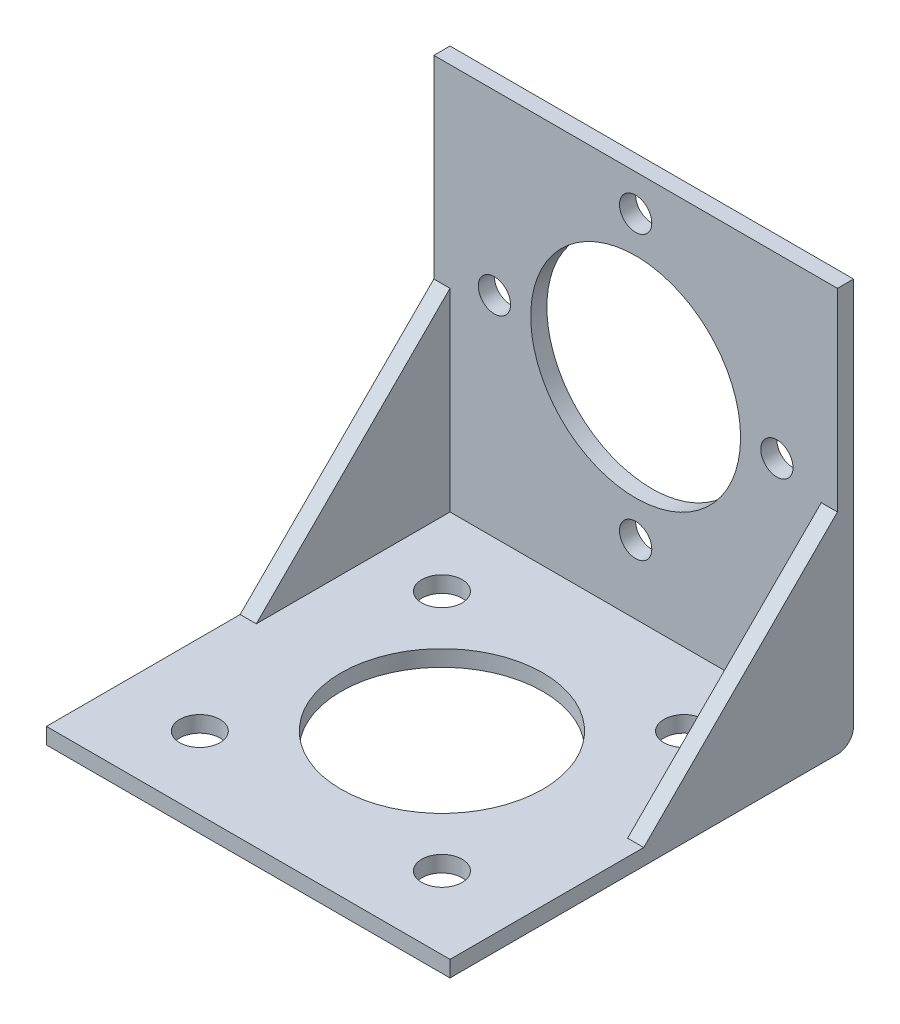
ISO-10303-21;
HEADER;
FILE_DESCRIPTION(('STEP AP214'),'2;1');
FILE_NAME('part.step','',(''),(''),'','','');
FILE_SCHEMA(('AUTOMOTIVE_DESIGN { 1 0 10303 214 1 1 1 1 }'));
ENDSEC;
DATA;
#1=APPLICATION_CONTEXT('core data for automotive mechanical design processes');
#2=APPLICATION_PROTOCOL_DEFINITION('international standard','automotive_design',2000,#1);
#3=PRODUCT_CONTEXT('',#1,'mechanical');
#4=PRODUCT('Part','Part','',(#3));
#5=PRODUCT_RELATED_PRODUCT_CATEGORY('part','',(#4));
#6=PRODUCT_DEFINITION_FORMATION('','',#4);
#7=PRODUCT_DEFINITION_CONTEXT('part definition',#1,'design');
#8=PRODUCT_DEFINITION('design','',#6,#7);
#9=PRODUCT_DEFINITION_SHAPE('','',#8);
#10=(LENGTH_UNIT() NAMED_UNIT(*) SI_UNIT(.MILLI.,.METRE.));
#11=(NAMED_UNIT(*) PLANE_ANGLE_UNIT() SI_UNIT($,.RADIAN.));
#12=(NAMED_UNIT(*) SI_UNIT($,.STERADIAN.) SOLID_ANGLE_UNIT());
#13=UNCERTAINTY_MEASURE_WITH_UNIT(LENGTH_MEASURE(1.E-05),#10,'distance_accuracy_value','');
#14=(GEOMETRIC_REPRESENTATION_CONTEXT(3) GLOBAL_UNCERTAINTY_ASSIGNED_CONTEXT((#13)) GLOBAL_UNIT_ASSIGNED_CONTEXT((#10,
#11,#12)) REPRESENTATION_CONTEXT('',''));
#15=CARTESIAN_POINT('',(0.,0.,0.));
#16=DIRECTION('',(0.,0.,1.));
#17=DIRECTION('',(1.,0.,0.));
#18=AXIS2_PLACEMENT_3D('',#15,#16,#17);
#19=CARTESIAN_POINT('',(50.,0.,0.));
#20=DIRECTION('',(0.,1.,0.));
#21=DIRECTION('',(0.,0.,1.));
#22=AXIS2_PLACEMENT_3D('',#19,#20,#21);
#23=PLANE('',#22);
#24=CARTESIAN_POINT('',(10.0000000000003,0.,40.9999999999998));
#25=DIRECTION('',(0.,1.,0.));
#26=DIRECTION('',(0.,0.,1.));
#27=AXIS2_PLACEMENT_3D('',#24,#25,#26);
#28=CIRCLE('',#27,2.49999999999999);
#29=CARTESIAN_POINT('',(10.0000000000003,0.,43.4999999999998));
#30=VERTEX_POINT('',#29);
#31=EDGE_CURVE('E332',#30,#30,#28,.T.);
#32=ORIENTED_EDGE('',*,*,#31,.T.);
#33=EDGE_LOOP('',(#32));
#34=FACE_BOUND('',#33,.T.);
#35=CARTESIAN_POINT('',(40.0000000000003,0.,40.9999999999997));
#36=DIRECTION('',(0.,1.,0.));
#37=DIRECTION('',(0.,0.,1.));
#38=AXIS2_PLACEMENT_3D('',#35,#36,#37);
#39=CIRCLE('',#38,2.5);
#40=CARTESIAN_POINT('',(40.0000000000003,0.,43.4999999999997));
#41=VERTEX_POINT('',#40);
#42=EDGE_CURVE('E326',#41,#41,#39,.T.);
#43=ORIENTED_EDGE('',*,*,#42,.T.);
#44=EDGE_LOOP('',(#43));
#45=FACE_BOUND('',#44,.T.);
#46=CARTESIAN_POINT('',(40.,0.,10.9999999999996));
#47=DIRECTION('',(0.,1.,0.));
#48=DIRECTION('',(0.,0.,1.));
#49=AXIS2_PLACEMENT_3D('',#46,#47,#48);
#50=CIRCLE('',#49,2.5);
#51=CARTESIAN_POINT('',(40.,0.,13.4999999999996));
#52=VERTEX_POINT('',#51);
#53=EDGE_CURVE('E316',#52,#52,#50,.T.);
#54=ORIENTED_EDGE('',*,*,#53,.T.);
#55=EDGE_LOOP('',(#54));
#56=FACE_BOUND('',#55,.T.);
#57=CARTESIAN_POINT('',(10.,0.,11.));
#58=DIRECTION('',(0.,1.,0.));
#59=DIRECTION('',(0.,0.,1.));
#60=AXIS2_PLACEMENT_3D('',#57,#58,#59);
#61=CIRCLE('',#60,2.5);
#62=CARTESIAN_POINT('',(10.,0.,13.5));
#63=VERTEX_POINT('',#62);
#64=EDGE_CURVE('E311',#63,#63,#61,.T.);
#65=ORIENTED_EDGE('',*,*,#64,.T.);
#66=EDGE_LOOP('',(#65));
#67=FACE_BOUND('',#66,.T.);
#68=CARTESIAN_POINT('',(25.,0.,26.));
#69=DIRECTION('',(0.,1.,0.));
#70=DIRECTION('',(0.,0.,1.));
#71=AXIS2_PLACEMENT_3D('',#68,#69,#70);
#72=CIRCLE('',#71,12.5);
#73=CARTESIAN_POINT('',(25.,0.,38.5));
#74=VERTEX_POINT('',#73);
#75=EDGE_CURVE('E337',#74,#74,#72,.T.);
#76=ORIENTED_EDGE('',*,*,#75,.T.);
#77=EDGE_LOOP('',(#76));
#78=FACE_BOUND('',#77,.T.);
#79=DIRECTION('',(0.,0.,-1.));
#80=VECTOR('',#79,1.);
#81=CARTESIAN_POINT('',(0.,0.,0.));
#82=LINE('',#81,#80);
#83=CARTESIAN_POINT('',(0.,0.,50.));
#84=VERTEX_POINT('',#83);
#85=CARTESIAN_POINT('',(0.,0.,2.));
#86=VERTEX_POINT('',#85);
#87=EDGE_CURVE('E168',#84,#86,#82,.T.);
#88=ORIENTED_EDGE('',*,*,#87,.T.);
#89=DIRECTION('',(-1.,0.,0.));
#90=VECTOR('',#89,1.);
#91=CARTESIAN_POINT('',(50.,0.,2.));
#92=LINE('',#91,#90);
#93=CARTESIAN_POINT('',(50.,0.,2.));
#94=VERTEX_POINT('',#93);
#95=EDGE_CURVE('E43',#86,#94,#92,.F.);
#96=ORIENTED_EDGE('',*,*,#95,.T.);
#97=DIRECTION('',(0.,0.,-1.));
#98=VECTOR('',#97,1.);
#99=CARTESIAN_POINT('',(50.,0.,0.));
#100=LINE('',#99,#98);
#101=CARTESIAN_POINT('',(50.,0.,50.));
#102=VERTEX_POINT('',#101);
#103=EDGE_CURVE('E171',#102,#94,#100,.T.);
#104=ORIENTED_EDGE('',*,*,#103,.F.);
#105=DIRECTION('',(-1.,0.,0.));
#106=VECTOR('',#105,1.);
#107=CARTESIAN_POINT('',(50.,0.,50.));
#108=LINE('',#107,#106);
#109=EDGE_CURVE('E184',#102,#84,#108,.T.);
#110=ORIENTED_EDGE('',*,*,#109,.T.);
#111=EDGE_LOOP('',(#88,#96,#104,#110));
#112=FACE_BOUND('',#111,.T.);
#113=ADVANCED_FACE('F35',(#34,#45,#56,#67,#78,#112),#23,.F.);
#114=CARTESIAN_POINT('',(50.,0.,0.));
#115=DIRECTION('',(0.,0.,1.));
#116=DIRECTION('',(1.,0.,0.));
#117=AXIS2_PLACEMENT_3D('',#114,#115,#116);
#118=PLANE('',#117);
#119=CARTESIAN_POINT('',(25.,45.5,0.));
#120=DIRECTION('',(0.,0.,1.));
#121=DIRECTION('',(1.,0.,0.));
#122=AXIS2_PLACEMENT_3D('',#119,#120,#121);
#123=CIRCLE('',#122,2.);
#124=CARTESIAN_POINT('',(27.,45.5,0.));
#125=VERTEX_POINT('',#124);
#126=EDGE_CURVE('E355',#125,#125,#123,.T.);
#127=ORIENTED_EDGE('',*,*,#126,.T.);
#128=EDGE_LOOP('',(#127));
#129=FACE_BOUND('',#128,.T.);
#130=CARTESIAN_POINT('',(42.5000000000002,28.0000000000002,0.));
#131=DIRECTION('',(0.,0.,1.));
#132=DIRECTION('',(1.,0.,0.));
#133=AXIS2_PLACEMENT_3D('',#130,#131,#132);
#134=CIRCLE('',#133,2.);
#135=CARTESIAN_POINT('',(44.5000000000002,28.0000000000002,0.));
#136=VERTEX_POINT('',#135);
#137=EDGE_CURVE('E361',#136,#136,#134,.T.);
#138=ORIENTED_EDGE('',*,*,#137,.T.);
#139=EDGE_LOOP('',(#138));
#140=FACE_BOUND('',#139,.T.);
#141=CARTESIAN_POINT('',(25.0000000000004,10.5,0.));
#142=DIRECTION('',(0.,0.,1.));
#143=DIRECTION('',(1.,0.,0.));
#144=AXIS2_PLACEMENT_3D('',#141,#142,#143);
#145=CIRCLE('',#144,2.);
#146=CARTESIAN_POINT('',(27.0000000000004,10.5,0.));
#147=VERTEX_POINT('',#146);
#148=EDGE_CURVE('E343',#147,#147,#145,.T.);
#149=ORIENTED_EDGE('',*,*,#148,.T.);
#150=EDGE_LOOP('',(#149));
#151=FACE_BOUND('',#150,.T.);
#152=CARTESIAN_POINT('',(7.50000000000024,27.9999999999999,0.));
#153=DIRECTION('',(0.,0.,1.));
#154=DIRECTION('',(1.,0.,0.));
#155=AXIS2_PLACEMENT_3D('',#152,#153,#154);
#156=CIRCLE('',#155,2.);
#157=CARTESIAN_POINT('',(9.50000000000025,27.9999999999999,0.));
#158=VERTEX_POINT('',#157);
#159=EDGE_CURVE('E350',#158,#158,#156,.T.);
#160=ORIENTED_EDGE('',*,*,#159,.T.);
#161=EDGE_LOOP('',(#160));
#162=FACE_BOUND('',#161,.T.);
#163=CARTESIAN_POINT('',(25.,28.,0.));
#164=DIRECTION('',(0.,0.,1.));
#165=DIRECTION('',(1.,0.,0.));
#166=AXIS2_PLACEMENT_3D('',#163,#164,#165);
#167=CIRCLE('',#166,13.);
#168=CARTESIAN_POINT('',(38.,28.,0.));
#169=VERTEX_POINT('',#168);
#170=EDGE_CURVE('E144',#169,#169,#167,.T.);
#171=ORIENTED_EDGE('',*,*,#170,.T.);
#172=EDGE_LOOP('',(#171));
#173=FACE_BOUND('',#172,.T.);
#174=DIRECTION('',(0.,1.,0.));
#175=VECTOR('',#174,1.);
#176=CARTESIAN_POINT('',(50.,0.,0.));
#177=LINE('',#176,#175);
#178=CARTESIAN_POINT('',(50.,2.,0.));
#179=VERTEX_POINT('',#178);
#180=CARTESIAN_POINT('',(50.,50.,0.));
#181=VERTEX_POINT('',#180);
#182=EDGE_CURVE('E173',#179,#181,#177,.T.);
#183=ORIENTED_EDGE('',*,*,#182,.F.);
#184=DIRECTION('',(-1.,0.,0.));
#185=VECTOR('',#184,1.);
#186=CARTESIAN_POINT('',(50.,2.,0.));
#187=LINE('',#186,#185);
#188=CARTESIAN_POINT('',(0.,2.,0.));
#189=VERTEX_POINT('',#188);
#190=EDGE_CURVE('E204',#179,#189,#187,.T.);
#191=ORIENTED_EDGE('',*,*,#190,.T.);
#192=DIRECTION('',(0.,1.,0.));
#193=VECTOR('',#192,1.);
#194=CARTESIAN_POINT('',(0.,0.,0.));
#195=LINE('',#194,#193);
#196=CARTESIAN_POINT('',(0.,50.,0.));
#197=VERTEX_POINT('',#196);
#198=EDGE_CURVE('E186',#189,#197,#195,.T.);
#199=ORIENTED_EDGE('',*,*,#198,.T.);
#200=DIRECTION('',(-1.,0.,0.));
#201=VECTOR('',#200,1.);
#202=CARTESIAN_POINT('',(50.,50.,0.));
#203=LINE('',#202,#201);
#204=EDGE_CURVE('E201',#181,#197,#203,.T.);
#205=ORIENTED_EDGE('',*,*,#204,.F.);
#206=EDGE_LOOP('',(#183,#191,#199,#205));
#207=FACE_BOUND('',#206,.T.);
#208=ADVANCED_FACE('F210',(#129,#140,#151,#162,#173,#207),#118,.F.);
#209=CARTESIAN_POINT('',(50.,50.,2.));
#210=DIRECTION('',(0.,-1.,0.));
#211=DIRECTION('',(0.,0.,-1.));
#212=AXIS2_PLACEMENT_3D('',#209,#210,#211);
#213=PLANE('',#212);
#214=DIRECTION('',(0.,0.,1.));
#215=VECTOR('',#214,1.);
#216=CARTESIAN_POINT('',(0.,50.,2.));
#217=LINE('',#216,#215);
#218=CARTESIAN_POINT('',(0.,50.,2.));
#219=VERTEX_POINT('',#218);
#220=EDGE_CURVE('E188',#197,#219,#217,.T.);
#221=ORIENTED_EDGE('',*,*,#220,.T.);
#222=DIRECTION('',(-1.,0.,0.));
#223=VECTOR('',#222,1.);
#224=CARTESIAN_POINT('',(50.,50.,2.));
#225=LINE('',#224,#223);
#226=CARTESIAN_POINT('',(50.,50.,2.));
#227=VERTEX_POINT('',#226);
#228=EDGE_CURVE('E198',#227,#219,#225,.T.);
#229=ORIENTED_EDGE('',*,*,#228,.F.);
#230=DIRECTION('',(0.,0.,1.));
#231=VECTOR('',#230,1.);
#232=CARTESIAN_POINT('',(50.,50.,2.));
#233=LINE('',#232,#231);
#234=EDGE_CURVE('E175',#181,#227,#233,.T.);
#235=ORIENTED_EDGE('',*,*,#234,.F.);
#236=ORIENTED_EDGE('',*,*,#204,.T.);
#237=EDGE_LOOP('',(#221,#229,#235,#236));
#238=FACE_BOUND('',#237,.T.);
#239=ADVANCED_FACE('F217',(#238),#213,.F.);
#240=CARTESIAN_POINT('',(50.,1.99999999999999,2.));
#241=DIRECTION('',(0.,0.,-1.));
#242=DIRECTION('',(-1.,0.,0.));
#243=AXIS2_PLACEMENT_3D('',#240,#241,#242);
#244=PLANE('',#243);
#245=CARTESIAN_POINT('',(25.,45.5,2.));
#246=DIRECTION('',(0.,0.,1.));
#247=DIRECTION('',(1.,0.,0.));
#248=AXIS2_PLACEMENT_3D('',#245,#246,#247);
#249=CIRCLE('',#248,2.);
#250=CARTESIAN_POINT('',(27.,45.5,2.));
#251=VERTEX_POINT('',#250);
#252=EDGE_CURVE('E358',#251,#251,#249,.T.);
#253=ORIENTED_EDGE('',*,*,#252,.F.);
#254=EDGE_LOOP('',(#253));
#255=FACE_BOUND('',#254,.T.);
#256=CARTESIAN_POINT('',(42.5000000000002,28.0000000000002,2.));
#257=DIRECTION('',(0.,0.,1.));
#258=DIRECTION('',(1.,0.,0.));
#259=AXIS2_PLACEMENT_3D('',#256,#257,#258);
#260=CIRCLE('',#259,2.);
#261=CARTESIAN_POINT('',(44.5000000000002,28.0000000000002,2.));
#262=VERTEX_POINT('',#261);
#263=EDGE_CURVE('E346',#262,#262,#260,.T.);
#264=ORIENTED_EDGE('',*,*,#263,.F.);
#265=EDGE_LOOP('',(#264));
#266=FACE_BOUND('',#265,.T.);
#267=CARTESIAN_POINT('',(25.0000000000004,10.5,2.));
#268=DIRECTION('',(0.,0.,1.));
#269=DIRECTION('',(1.,0.,0.));
#270=AXIS2_PLACEMENT_3D('',#267,#268,#269);
#271=CIRCLE('',#270,2.);
#272=CARTESIAN_POINT('',(27.0000000000004,10.5,2.));
#273=VERTEX_POINT('',#272);
#274=EDGE_CURVE('E347',#273,#273,#271,.T.);
#275=ORIENTED_EDGE('',*,*,#274,.F.);
#276=EDGE_LOOP('',(#275));
#277=FACE_BOUND('',#276,.T.);
#278=CARTESIAN_POINT('',(7.50000000000024,27.9999999999999,2.));
#279=DIRECTION('',(0.,0.,1.));
#280=DIRECTION('',(1.,0.,0.));
#281=AXIS2_PLACEMENT_3D('',#278,#279,#280);
#282=CIRCLE('',#281,2.);
#283=CARTESIAN_POINT('',(9.50000000000025,27.9999999999999,2.));
#284=VERTEX_POINT('',#283);
#285=EDGE_CURVE('E340',#284,#284,#282,.T.);
#286=ORIENTED_EDGE('',*,*,#285,.F.);
#287=EDGE_LOOP('',(#286));
#288=FACE_BOUND('',#287,.T.);
#289=CARTESIAN_POINT('',(25.,28.,2.));
#290=DIRECTION('',(0.,0.,1.));
#291=DIRECTION('',(1.,0.,0.));
#292=AXIS2_PLACEMENT_3D('',#289,#290,#291);
#293=CIRCLE('',#292,13.);
#294=CARTESIAN_POINT('',(38.,28.,2.));
#295=VERTEX_POINT('',#294);
#296=EDGE_CURVE('E148',#295,#295,#293,.T.);
#297=ORIENTED_EDGE('',*,*,#296,.F.);
#298=EDGE_LOOP('',(#297));
#299=FACE_BOUND('',#298,.T.);
#300=DIRECTION('',(0.,-1.,0.));
#301=VECTOR('',#300,1.);
#302=CARTESIAN_POINT('',(0.,1.99999999999999,2.));
#303=LINE('',#302,#301);
#304=CARTESIAN_POINT('',(0.,26.,2.));
#305=VERTEX_POINT('',#304);
#306=EDGE_CURVE('E127',#219,#305,#303,.T.);
#307=ORIENTED_EDGE('',*,*,#306,.T.);
#308=DIRECTION('',(-1.,0.,0.));
#309=VECTOR('',#308,1.);
#310=CARTESIAN_POINT('',(2.,26.,2.));
#311=LINE('',#310,#309);
#312=CARTESIAN_POINT('',(2.,26.,2.));
#313=VERTEX_POINT('',#312);
#314=EDGE_CURVE('E138',#313,#305,#311,.T.);
#315=ORIENTED_EDGE('',*,*,#314,.F.);
#316=DIRECTION('',(0.,-1.,0.));
#317=VECTOR('',#316,1.);
#318=CARTESIAN_POINT('',(2.,1.99999999999999,2.));
#319=LINE('',#318,#317);
#320=CARTESIAN_POINT('',(2.,1.99999999999999,2.));
#321=VERTEX_POINT('',#320);
#322=EDGE_CURVE('E143',#313,#321,#319,.T.);
#323=ORIENTED_EDGE('',*,*,#322,.T.);
#324=DIRECTION('',(-1.,0.,0.));
#325=VECTOR('',#324,1.);
#326=CARTESIAN_POINT('',(50.,1.99999999999999,2.));
#327=LINE('',#326,#325);
#328=CARTESIAN_POINT('',(48.,1.99999999999999,2.));
#329=VERTEX_POINT('',#328);
#330=EDGE_CURVE('E196',#329,#321,#327,.T.);
#331=ORIENTED_EDGE('',*,*,#330,.F.);
#332=DIRECTION('',(0.,1.,0.));
#333=VECTOR('',#332,1.);
#334=CARTESIAN_POINT('',(48.,1.99999999999999,2.));
#335=LINE('',#334,#333);
#336=CARTESIAN_POINT('',(48.,26.,2.));
#337=VERTEX_POINT('',#336);
#338=EDGE_CURVE('E155',#329,#337,#335,.T.);
#339=ORIENTED_EDGE('',*,*,#338,.T.);
#340=DIRECTION('',(1.,0.,0.));
#341=VECTOR('',#340,1.);
#342=CARTESIAN_POINT('',(48.,26.,2.));
#343=LINE('',#342,#341);
#344=CARTESIAN_POINT('',(50.,26.,2.));
#345=VERTEX_POINT('',#344);
#346=EDGE_CURVE('E163',#337,#345,#343,.T.);
#347=ORIENTED_EDGE('',*,*,#346,.T.);
#348=DIRECTION('',(0.,-1.,0.));
#349=VECTOR('',#348,1.);
#350=CARTESIAN_POINT('',(50.,1.99999999999999,2.));
#351=LINE('',#350,#349);
#352=EDGE_CURVE('E177',#227,#345,#351,.T.);
#353=ORIENTED_EDGE('',*,*,#352,.F.);
#354=ORIENTED_EDGE('',*,*,#228,.T.);
#355=EDGE_LOOP('',(#307,#315,#323,#331,#339,#347,#353,#354));
#356=FACE_BOUND('',#355,.T.);
#357=ADVANCED_FACE('F221',(#255,#266,#277,#288,#299,#356),#244,.F.);
#358=CARTESIAN_POINT('',(50.,1.99999999999999,50.));
#359=DIRECTION('',(0.,-1.,0.));
#360=DIRECTION('',(0.,0.,-1.));
#361=AXIS2_PLACEMENT_3D('',#358,#359,#360);
#362=PLANE('',#361);
#363=CARTESIAN_POINT('',(10.0000000000003,1.99999999999999,40.9999999999998));
#364=DIRECTION('',(0.,1.,0.));
#365=DIRECTION('',(0.,0.,1.));
#366=AXIS2_PLACEMENT_3D('',#363,#364,#365);
#367=CIRCLE('',#366,2.49999999999999);
#368=CARTESIAN_POINT('',(10.0000000000003,1.99999999999999,43.4999999999998));
#369=VERTEX_POINT('',#368);
#370=EDGE_CURVE('E334',#369,#369,#367,.T.);
#371=ORIENTED_EDGE('',*,*,#370,.F.);
#372=EDGE_LOOP('',(#371));
#373=FACE_BOUND('',#372,.T.);
#374=CARTESIAN_POINT('',(40.0000000000003,1.99999999999999,40.9999999999997));
#375=DIRECTION('',(0.,1.,0.));
#376=DIRECTION('',(0.,0.,1.));
#377=AXIS2_PLACEMENT_3D('',#374,#375,#376);
#378=CIRCLE('',#377,2.5);
#379=CARTESIAN_POINT('',(40.0000000000003,1.99999999999999,43.4999999999997));
#380=VERTEX_POINT('',#379);
#381=EDGE_CURVE('E329',#380,#380,#378,.T.);
#382=ORIENTED_EDGE('',*,*,#381,.F.);
#383=EDGE_LOOP('',(#382));
#384=FACE_BOUND('',#383,.T.);
#385=CARTESIAN_POINT('',(40.,1.99999999999999,10.9999999999996));
#386=DIRECTION('',(0.,1.,0.));
#387=DIRECTION('',(0.,0.,1.));
#388=AXIS2_PLACEMENT_3D('',#385,#386,#387);
#389=CIRCLE('',#388,2.5);
#390=CARTESIAN_POINT('',(40.,1.99999999999999,13.4999999999996));
#391=VERTEX_POINT('',#390);
#392=EDGE_CURVE('E321',#391,#391,#389,.T.);
#393=ORIENTED_EDGE('',*,*,#392,.F.);
#394=EDGE_LOOP('',(#393));
#395=FACE_BOUND('',#394,.T.);
#396=CARTESIAN_POINT('',(10.,1.99999999999999,11.));
#397=DIRECTION('',(0.,1.,0.));
#398=DIRECTION('',(0.,0.,1.));
#399=AXIS2_PLACEMENT_3D('',#396,#397,#398);
#400=CIRCLE('',#399,2.5);
#401=CARTESIAN_POINT('',(10.,1.99999999999999,13.5));
#402=VERTEX_POINT('',#401);
#403=EDGE_CURVE('E314',#402,#402,#400,.T.);
#404=ORIENTED_EDGE('',*,*,#403,.F.);
#405=EDGE_LOOP('',(#404));
#406=FACE_BOUND('',#405,.T.);
#407=CARTESIAN_POINT('',(25.,1.99999999999999,26.));
#408=DIRECTION('',(0.,1.,0.));
#409=DIRECTION('',(0.,0.,1.));
#410=AXIS2_PLACEMENT_3D('',#407,#408,#409);
#411=CIRCLE('',#410,12.5);
#412=CARTESIAN_POINT('',(25.,1.99999999999999,38.5));
#413=VERTEX_POINT('',#412);
#414=EDGE_CURVE('E318',#413,#413,#411,.T.);
#415=ORIENTED_EDGE('',*,*,#414,.F.);
#416=EDGE_LOOP('',(#415));
#417=FACE_BOUND('',#416,.T.);
#418=DIRECTION('',(0.,0.,1.));
#419=VECTOR('',#418,1.);
#420=CARTESIAN_POINT('',(2.,1.99999999999999,26.));
#421=LINE('',#420,#419);
#422=CARTESIAN_POINT('',(2.,1.99999999999999,26.));
#423=VERTEX_POINT('',#422);
#424=EDGE_CURVE('E134',#321,#423,#421,.T.);
#425=ORIENTED_EDGE('',*,*,#424,.T.);
#426=DIRECTION('',(-1.,0.,0.));
#427=VECTOR('',#426,1.);
#428=CARTESIAN_POINT('',(2.,1.99999999999999,26.));
#429=LINE('',#428,#427);
#430=CARTESIAN_POINT('',(0.,1.99999999999999,26.));
#431=VERTEX_POINT('',#430);
#432=EDGE_CURVE('E130',#423,#431,#429,.T.);
#433=ORIENTED_EDGE('',*,*,#432,.T.);
#434=DIRECTION('',(0.,0.,1.));
#435=VECTOR('',#434,1.);
#436=CARTESIAN_POINT('',(0.,1.99999999999999,50.));
#437=LINE('',#436,#435);
#438=CARTESIAN_POINT('',(0.,1.99999999999999,50.));
#439=VERTEX_POINT('',#438);
#440=EDGE_CURVE('E117',#431,#439,#437,.T.);
#441=ORIENTED_EDGE('',*,*,#440,.T.);
#442=DIRECTION('',(-1.,0.,0.));
#443=VECTOR('',#442,1.);
#444=CARTESIAN_POINT('',(50.,1.99999999999999,50.));
#445=LINE('',#444,#443);
#446=CARTESIAN_POINT('',(50.,1.99999999999999,50.));
#447=VERTEX_POINT('',#446);
#448=EDGE_CURVE('E194',#447,#439,#445,.T.);
#449=ORIENTED_EDGE('',*,*,#448,.F.);
#450=DIRECTION('',(0.,0.,1.));
#451=VECTOR('',#450,1.);
#452=CARTESIAN_POINT('',(50.,1.99999999999999,50.));
#453=LINE('',#452,#451);
#454=CARTESIAN_POINT('',(50.,1.99999999999999,26.));
#455=VERTEX_POINT('',#454);
#456=EDGE_CURVE('E180',#455,#447,#453,.T.);
#457=ORIENTED_EDGE('',*,*,#456,.F.);
#458=DIRECTION('',(1.,0.,0.));
#459=VECTOR('',#458,1.);
#460=CARTESIAN_POINT('',(48.,1.99999999999999,26.));
#461=LINE('',#460,#459);
#462=CARTESIAN_POINT('',(48.,1.99999999999999,26.));
#463=VERTEX_POINT('',#462);
#464=EDGE_CURVE('E165',#463,#455,#461,.T.);
#465=ORIENTED_EDGE('',*,*,#464,.F.);
#466=DIRECTION('',(0.,0.,-1.));
#467=VECTOR('',#466,1.);
#468=CARTESIAN_POINT('',(48.,1.99999999999999,26.));
#469=LINE('',#468,#467);
#470=EDGE_CURVE('E160',#463,#329,#469,.T.);
#471=ORIENTED_EDGE('',*,*,#470,.T.);
#472=ORIENTED_EDGE('',*,*,#330,.T.);
#473=EDGE_LOOP('',(#425,#433,#441,#449,#457,#465,#471,#472));
#474=FACE_BOUND('',#473,.T.);
#475=ADVANCED_FACE('F131',(#373,#384,#395,#406,#417,#474),#362,.F.);
#476=CARTESIAN_POINT('',(50.,0.,50.));
#477=DIRECTION('',(0.,0.,-1.));
#478=DIRECTION('',(-1.,0.,0.));
#479=AXIS2_PLACEMENT_3D('',#476,#477,#478);
#480=PLANE('',#479);
#481=DIRECTION('',(0.,-1.,0.));
#482=VECTOR('',#481,1.);
#483=CARTESIAN_POINT('',(0.,0.,50.));
#484=LINE('',#483,#482);
#485=EDGE_CURVE('E123',#439,#84,#484,.T.);
#486=ORIENTED_EDGE('',*,*,#485,.T.);
#487=ORIENTED_EDGE('',*,*,#109,.F.);
#488=DIRECTION('',(0.,-1.,0.));
#489=VECTOR('',#488,1.);
#490=CARTESIAN_POINT('',(50.,0.,50.));
#491=LINE('',#490,#489);
#492=EDGE_CURVE('E182',#447,#102,#491,.T.);
#493=ORIENTED_EDGE('',*,*,#492,.F.);
#494=ORIENTED_EDGE('',*,*,#448,.T.);
#495=EDGE_LOOP('',(#486,#487,#493,#494));
#496=FACE_BOUND('',#495,.T.);
#497=ADVANCED_FACE('F249',(#496),#480,.F.);
#498=CARTESIAN_POINT('',(50.,0.,0.));
#499=DIRECTION('',(-1.,0.,0.));
#500=DIRECTION('',(0.,0.,1.));
#501=AXIS2_PLACEMENT_3D('',#498,#499,#500);
#502=PLANE('',#501);
#503=ORIENTED_EDGE('',*,*,#103,.T.);
#504=CARTESIAN_POINT('',(50.,2.,2.));
#505=DIRECTION('',(-1.,0.,0.));
#506=DIRECTION('',(0.,0.,1.));
#507=AXIS2_PLACEMENT_3D('',#504,#505,#506);
#508=CIRCLE('',#507,2.);
#509=EDGE_CURVE('E11',#94,#179,#508,.F.);
#510=ORIENTED_EDGE('',*,*,#509,.T.);
#511=ORIENTED_EDGE('',*,*,#182,.T.);
#512=ORIENTED_EDGE('',*,*,#234,.T.);
#513=ORIENTED_EDGE('',*,*,#352,.T.);
#514=DIRECTION('',(0.,-0.707106781186548,0.707106781186547));
#515=VECTOR('',#514,1.);
#516=CARTESIAN_POINT('',(50.,26.,2.));
#517=LINE('',#516,#515);
#518=EDGE_CURVE('E153',#345,#455,#517,.T.);
#519=ORIENTED_EDGE('',*,*,#518,.T.);
#520=ORIENTED_EDGE('',*,*,#456,.T.);
#521=ORIENTED_EDGE('',*,*,#492,.T.);
#522=EDGE_LOOP('',(#503,#510,#511,#512,#513,#519,#520,#521));
#523=FACE_BOUND('',#522,.T.);
#524=ADVANCED_FACE('F223',(#523),#502,.F.);
#525=CARTESIAN_POINT('',(0.,0.,0.));
#526=DIRECTION('',(-1.,0.,0.));
#527=DIRECTION('',(0.,0.,1.));
#528=AXIS2_PLACEMENT_3D('',#525,#526,#527);
#529=PLANE('',#528);
#530=ORIENTED_EDGE('',*,*,#198,.F.);
#531=CARTESIAN_POINT('',(0.,2.,2.));
#532=DIRECTION('',(-1.,0.,0.));
#533=DIRECTION('',(0.,0.,1.));
#534=AXIS2_PLACEMENT_3D('',#531,#532,#533);
#535=CIRCLE('',#534,2.);
#536=EDGE_CURVE('E57',#189,#86,#535,.T.);
#537=ORIENTED_EDGE('',*,*,#536,.T.);
#538=ORIENTED_EDGE('',*,*,#87,.F.);
#539=ORIENTED_EDGE('',*,*,#485,.F.);
#540=ORIENTED_EDGE('',*,*,#440,.F.);
#541=DIRECTION('',(0.,0.707106781186548,-0.707106781186547));
#542=VECTOR('',#541,1.);
#543=CARTESIAN_POINT('',(0.,26.,2.));
#544=LINE('',#543,#542);
#545=EDGE_CURVE('E122',#431,#305,#544,.T.);
#546=ORIENTED_EDGE('',*,*,#545,.T.);
#547=ORIENTED_EDGE('',*,*,#306,.F.);
#548=ORIENTED_EDGE('',*,*,#220,.F.);
#549=EDGE_LOOP('',(#530,#537,#538,#539,#540,#546,#547,#548));
#550=FACE_BOUND('',#549,.T.);
#551=ADVANCED_FACE('F119',(#550),#529,.T.);
#552=CARTESIAN_POINT('',(48.,26.,2.));
#553=DIRECTION('',(0.,0.707106781186547,0.707106781186548));
#554=DIRECTION('',(0.,-0.707106781186548,0.707106781186547));
#555=AXIS2_PLACEMENT_3D('',#552,#553,#554);
#556=PLANE('',#555);
#557=ORIENTED_EDGE('',*,*,#518,.F.);
#558=ORIENTED_EDGE('',*,*,#346,.F.);
#559=DIRECTION('',(0.,-0.707106781186548,0.707106781186547));
#560=VECTOR('',#559,1.);
#561=CARTESIAN_POINT('',(48.,26.,2.));
#562=LINE('',#561,#560);
#563=EDGE_CURVE('E158',#337,#463,#562,.T.);
#564=ORIENTED_EDGE('',*,*,#563,.T.);
#565=ORIENTED_EDGE('',*,*,#464,.T.);
#566=EDGE_LOOP('',(#557,#558,#564,#565));
#567=FACE_BOUND('',#566,.T.);
#568=ADVANCED_FACE('F256',(#567),#556,.T.);
#569=CARTESIAN_POINT('',(48.,0.,0.));
#570=DIRECTION('',(-1.,0.,0.));
#571=DIRECTION('',(0.,0.,1.));
#572=AXIS2_PLACEMENT_3D('',#569,#570,#571);
#573=PLANE('',#572);
#574=ORIENTED_EDGE('',*,*,#338,.F.);
#575=ORIENTED_EDGE('',*,*,#470,.F.);
#576=ORIENTED_EDGE('',*,*,#563,.F.);
#577=EDGE_LOOP('',(#574,#575,#576));
#578=FACE_BOUND('',#577,.T.);
#579=ADVANCED_FACE('F261',(#578),#573,.T.);
#580=CARTESIAN_POINT('',(2.,26.,2.));
#581=DIRECTION('',(0.,0.707106781186547,0.707106781186548));
#582=DIRECTION('',(0.,-0.707106781186548,0.707106781186547));
#583=AXIS2_PLACEMENT_3D('',#580,#581,#582);
#584=PLANE('',#583);
#585=ORIENTED_EDGE('',*,*,#545,.F.);
#586=ORIENTED_EDGE('',*,*,#432,.F.);
#587=DIRECTION('',(0.,0.707106781186548,-0.707106781186547));
#588=VECTOR('',#587,1.);
#589=CARTESIAN_POINT('',(2.,26.,2.));
#590=LINE('',#589,#588);
#591=EDGE_CURVE('E139',#423,#313,#590,.T.);
#592=ORIENTED_EDGE('',*,*,#591,.T.);
#593=ORIENTED_EDGE('',*,*,#314,.T.);
#594=EDGE_LOOP('',(#585,#586,#592,#593));
#595=FACE_BOUND('',#594,.T.);
#596=ADVANCED_FACE('F142',(#595),#584,.T.);
#597=CARTESIAN_POINT('',(2.,0.,0.));
#598=DIRECTION('',(-1.,0.,0.));
#599=DIRECTION('',(0.,0.,1.));
#600=AXIS2_PLACEMENT_3D('',#597,#598,#599);
#601=PLANE('',#600);
#602=ORIENTED_EDGE('',*,*,#322,.F.);
#603=ORIENTED_EDGE('',*,*,#591,.F.);
#604=ORIENTED_EDGE('',*,*,#424,.F.);
#605=EDGE_LOOP('',(#602,#603,#604));
#606=FACE_BOUND('',#605,.T.);
#607=ADVANCED_FACE('F268',(#606),#601,.F.);
#608=CARTESIAN_POINT('',(25.,28.,0.));
#609=DIRECTION('',(0.,0.,1.));
#610=DIRECTION('',(1.,0.,0.));
#611=AXIS2_PLACEMENT_3D('',#608,#609,#610);
#612=CYLINDRICAL_SURFACE('',#611,13.);
#613=ORIENTED_EDGE('',*,*,#170,.F.);
#614=EDGE_LOOP('',(#613));
#615=FACE_BOUND('',#614,.T.);
#616=ORIENTED_EDGE('',*,*,#296,.T.);
#617=EDGE_LOOP('',(#616));
#618=FACE_BOUND('',#617,.T.);
#619=ADVANCED_FACE('F271',(#615,#618),#612,.F.);
#620=CARTESIAN_POINT('',(7.50000000000024,27.9999999999999,0.));
#621=DIRECTION('',(0.,0.,1.));
#622=DIRECTION('',(1.,0.,0.));
#623=AXIS2_PLACEMENT_3D('',#620,#621,#622);
#624=CYLINDRICAL_SURFACE('',#623,2.);
#625=ORIENTED_EDGE('',*,*,#159,.F.);
#626=EDGE_LOOP('',(#625));
#627=FACE_BOUND('',#626,.T.);
#628=ORIENTED_EDGE('',*,*,#285,.T.);
#629=EDGE_LOOP('',(#628));
#630=FACE_BOUND('',#629,.T.);
#631=ADVANCED_FACE('F275',(#627,#630),#624,.F.);
#632=CARTESIAN_POINT('',(25.0000000000004,10.5,0.));
#633=DIRECTION('',(0.,0.,1.));
#634=DIRECTION('',(1.,0.,0.));
#635=AXIS2_PLACEMENT_3D('',#632,#633,#634);
#636=CYLINDRICAL_SURFACE('',#635,2.);
#637=ORIENTED_EDGE('',*,*,#148,.F.);
#638=EDGE_LOOP('',(#637));
#639=FACE_BOUND('',#638,.T.);
#640=ORIENTED_EDGE('',*,*,#274,.T.);
#641=EDGE_LOOP('',(#640));
#642=FACE_BOUND('',#641,.T.);
#643=ADVANCED_FACE('F281',(#639,#642),#636,.F.);
#644=CARTESIAN_POINT('',(42.5000000000002,28.0000000000002,0.));
#645=DIRECTION('',(0.,0.,1.));
#646=DIRECTION('',(1.,0.,0.));
#647=AXIS2_PLACEMENT_3D('',#644,#645,#646);
#648=CYLINDRICAL_SURFACE('',#647,2.);
#649=ORIENTED_EDGE('',*,*,#137,.F.);
#650=EDGE_LOOP('',(#649));
#651=FACE_BOUND('',#650,.T.);
#652=ORIENTED_EDGE('',*,*,#263,.T.);
#653=EDGE_LOOP('',(#652));
#654=FACE_BOUND('',#653,.T.);
#655=ADVANCED_FACE('F277',(#651,#654),#648,.F.);
#656=CARTESIAN_POINT('',(25.,45.5,0.));
#657=DIRECTION('',(0.,0.,1.));
#658=DIRECTION('',(1.,0.,0.));
#659=AXIS2_PLACEMENT_3D('',#656,#657,#658);
#660=CYLINDRICAL_SURFACE('',#659,2.);
#661=ORIENTED_EDGE('',*,*,#126,.F.);
#662=EDGE_LOOP('',(#661));
#663=FACE_BOUND('',#662,.T.);
#664=ORIENTED_EDGE('',*,*,#252,.T.);
#665=EDGE_LOOP('',(#664));
#666=FACE_BOUND('',#665,.T.);
#667=ADVANCED_FACE('F280',(#663,#666),#660,.F.);
#668=CARTESIAN_POINT('',(25.,0.,26.));
#669=DIRECTION('',(0.,1.,0.));
#670=DIRECTION('',(0.,0.,1.));
#671=AXIS2_PLACEMENT_3D('',#668,#669,#670);
#672=CYLINDRICAL_SURFACE('',#671,12.5);
#673=ORIENTED_EDGE('',*,*,#75,.F.);
#674=EDGE_LOOP('',(#673));
#675=FACE_BOUND('',#674,.T.);
#676=ORIENTED_EDGE('',*,*,#414,.T.);
#677=EDGE_LOOP('',(#676));
#678=FACE_BOUND('',#677,.T.);
#679=ADVANCED_FACE('F285',(#675,#678),#672,.F.);
#680=CARTESIAN_POINT('',(10.,0.,11.));
#681=DIRECTION('',(0.,1.,0.));
#682=DIRECTION('',(0.,0.,1.));
#683=AXIS2_PLACEMENT_3D('',#680,#681,#682);
#684=CYLINDRICAL_SURFACE('',#683,2.5);
#685=ORIENTED_EDGE('',*,*,#64,.F.);
#686=EDGE_LOOP('',(#685));
#687=FACE_BOUND('',#686,.T.);
#688=ORIENTED_EDGE('',*,*,#403,.T.);
#689=EDGE_LOOP('',(#688));
#690=FACE_BOUND('',#689,.T.);
#691=ADVANCED_FACE('F294',(#687,#690),#684,.F.);
#692=CARTESIAN_POINT('',(40.,0.,10.9999999999996));
#693=DIRECTION('',(0.,1.,0.));
#694=DIRECTION('',(0.,0.,1.));
#695=AXIS2_PLACEMENT_3D('',#692,#693,#694);
#696=CYLINDRICAL_SURFACE('',#695,2.5);
#697=ORIENTED_EDGE('',*,*,#53,.F.);
#698=EDGE_LOOP('',(#697));
#699=FACE_BOUND('',#698,.T.);
#700=ORIENTED_EDGE('',*,*,#392,.T.);
#701=EDGE_LOOP('',(#700));
#702=FACE_BOUND('',#701,.T.);
#703=ADVANCED_FACE('F299',(#699,#702),#696,.F.);
#704=CARTESIAN_POINT('',(40.0000000000003,0.,40.9999999999997));
#705=DIRECTION('',(0.,1.,0.));
#706=DIRECTION('',(0.,0.,1.));
#707=AXIS2_PLACEMENT_3D('',#704,#705,#706);
#708=CYLINDRICAL_SURFACE('',#707,2.5);
#709=ORIENTED_EDGE('',*,*,#42,.F.);
#710=EDGE_LOOP('',(#709));
#711=FACE_BOUND('',#710,.T.);
#712=ORIENTED_EDGE('',*,*,#381,.T.);
#713=EDGE_LOOP('',(#712));
#714=FACE_BOUND('',#713,.T.);
#715=ADVANCED_FACE('F229',(#711,#714),#708,.F.);
#716=CARTESIAN_POINT('',(10.0000000000003,0.,40.9999999999998));
#717=DIRECTION('',(0.,1.,0.));
#718=DIRECTION('',(0.,0.,1.));
#719=AXIS2_PLACEMENT_3D('',#716,#717,#718);
#720=CYLINDRICAL_SURFACE('',#719,2.49999999999999);
#721=ORIENTED_EDGE('',*,*,#31,.F.);
#722=EDGE_LOOP('',(#721));
#723=FACE_BOUND('',#722,.T.);
#724=ORIENTED_EDGE('',*,*,#370,.T.);
#725=EDGE_LOOP('',(#724));
#726=FACE_BOUND('',#725,.T.);
#727=ADVANCED_FACE('F225',(#723,#726),#720,.F.);
#728=CARTESIAN_POINT('',(50.,2.,2.));
#729=DIRECTION('',(-1.,0.,0.));
#730=DIRECTION('',(0.,0.,1.));
#731=AXIS2_PLACEMENT_3D('',#728,#729,#730);
#732=CYLINDRICAL_SURFACE('',#731,2.);
#733=ORIENTED_EDGE('',*,*,#509,.F.);
#734=ORIENTED_EDGE('',*,*,#95,.F.);
#735=ORIENTED_EDGE('',*,*,#536,.F.);
#736=ORIENTED_EDGE('',*,*,#190,.F.);
#737=EDGE_LOOP('',(#733,#734,#735,#736));
#738=FACE_BOUND('',#737,.T.);
#739=ADVANCED_FACE('F37',(#738),#732,.T.);
#740=CLOSED_SHELL('',(#113,#208,#239,#357,#475,#497,#524,#551,#568,#579,#596,#607,#619,#631,
#643,#655,#667,#679,#691,#703,#715,#727,#739));
#741=MANIFOLD_SOLID_BREP('B2',#740);
#742=ADVANCED_BREP_SHAPE_REPRESENTATION('',(#18,#741),#14);
#743=SHAPE_DEFINITION_REPRESENTATION(#9,#742);
ENDSEC;
END-ISO-10303-21;
